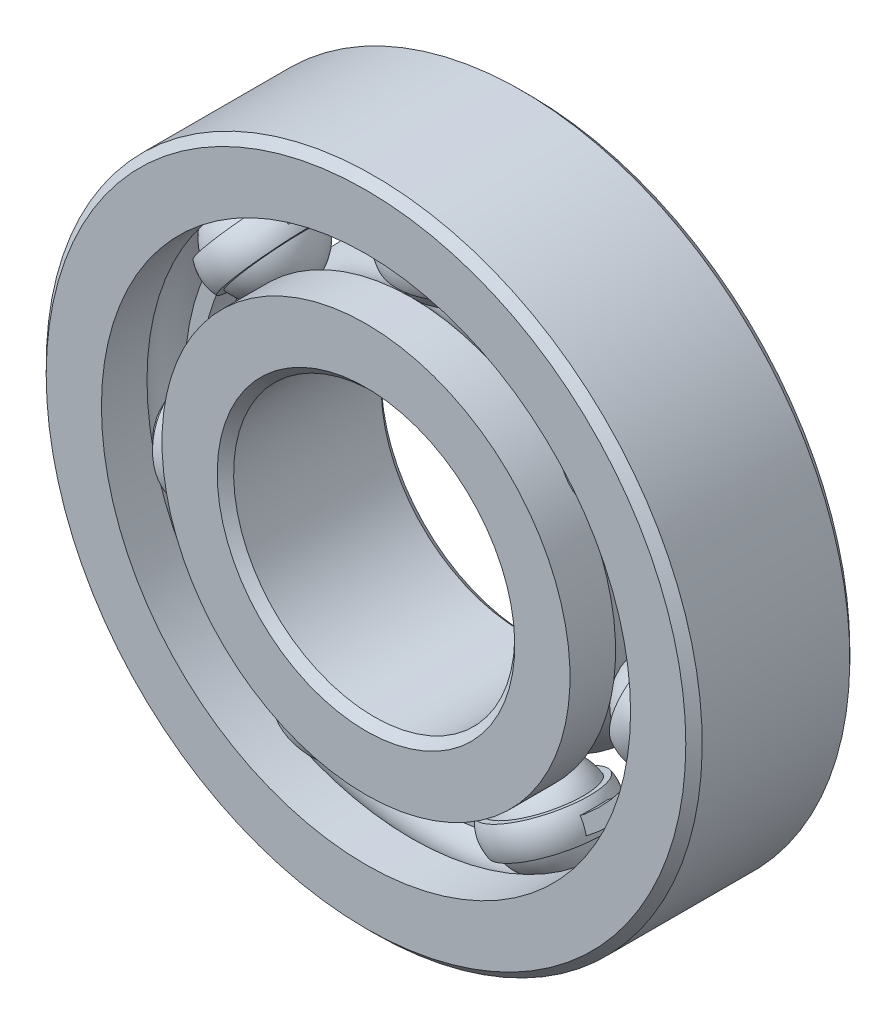
ISO-10303-21;
HEADER;
FILE_DESCRIPTION(('STEP AP214'),'2;1');
FILE_NAME('part.step','',(''),(''),'','','');
FILE_SCHEMA(('AUTOMOTIVE_DESIGN { 1 0 10303 214 1 1 1 1 }'));
ENDSEC;
DATA;
#1=APPLICATION_CONTEXT('core data for automotive mechanical design processes');
#2=APPLICATION_PROTOCOL_DEFINITION('international standard','automotive_design',2000,#1);
#3=PRODUCT_CONTEXT('',#1,'mechanical');
#4=PRODUCT('Part','Part','',(#3));
#5=PRODUCT_RELATED_PRODUCT_CATEGORY('part','',(#4));
#6=PRODUCT_DEFINITION_FORMATION('','',#4);
#7=PRODUCT_DEFINITION_CONTEXT('part definition',#1,'design');
#8=PRODUCT_DEFINITION('design','',#6,#7);
#9=PRODUCT_DEFINITION_SHAPE('','',#8);
#10=(LENGTH_UNIT() NAMED_UNIT(*) SI_UNIT(.MILLI.,.METRE.));
#11=(NAMED_UNIT(*) PLANE_ANGLE_UNIT() SI_UNIT($,.RADIAN.));
#12=(NAMED_UNIT(*) SI_UNIT($,.STERADIAN.) SOLID_ANGLE_UNIT());
#13=UNCERTAINTY_MEASURE_WITH_UNIT(LENGTH_MEASURE(1.E-05),#10,'distance_accuracy_value','');
#14=(GEOMETRIC_REPRESENTATION_CONTEXT(3) GLOBAL_UNCERTAINTY_ASSIGNED_CONTEXT((#13)) GLOBAL_UNIT_ASSIGNED_CONTEXT((#10,
#11,#12)) REPRESENTATION_CONTEXT('',''));
#15=CARTESIAN_POINT('',(0.,0.,0.));
#16=DIRECTION('',(0.,0.,1.));
#17=DIRECTION('',(1.,0.,0.));
#18=AXIS2_PLACEMENT_3D('',#15,#16,#17);
#19=CARTESIAN_POINT('',(0.,0.,0.463020833333333));
#20=DIRECTION('',(0.,0.,1.));
#21=DIRECTION('',(1.,0.,0.));
#22=AXIS2_PLACEMENT_3D('',#19,#20,#21);
#23=PLANE('',#22);
#24=CARTESIAN_POINT('',(0.,0.,0.463020833333333));
#25=DIRECTION('',(0.,0.,1.));
#26=DIRECTION('',(1.,0.,0.));
#27=AXIS2_PLACEMENT_3D('',#24,#25,#26);
#28=CIRCLE('',#27,8.45038461538461);
#29=CARTESIAN_POINT('',(8.45038461538461,0.,0.463020833333333));
#30=VERTEX_POINT('',#29);
#31=EDGE_CURVE('E11',#30,#30,#28,.T.);
#32=ORIENTED_EDGE('',*,*,#31,.T.);
#33=EDGE_LOOP('',(#32));
#34=FACE_BOUND('',#33,.T.);
#35=CARTESIAN_POINT('',(0.,0.,0.463020833333333));
#36=DIRECTION('',(0.,0.,1.));
#37=DIRECTION('',(1.,0.,0.));
#38=AXIS2_PLACEMENT_3D('',#35,#36,#37);
#39=CIRCLE('',#38,7.9375);
#40=CARTESIAN_POINT('',(7.9375,0.,0.463020833333333));
#41=VERTEX_POINT('',#40);
#42=EDGE_CURVE('E55',#41,#41,#39,.T.);
#43=ORIENTED_EDGE('',*,*,#42,.F.);
#44=EDGE_LOOP('',(#43));
#45=FACE_BOUND('',#44,.T.);
#46=ADVANCED_FACE('F44',(#34,#45),#23,.T.);
#47=CARTESIAN_POINT('',(0.,0.,-0.463020833333333));
#48=DIRECTION('',(0.,0.,1.));
#49=DIRECTION('',(1.,0.,0.));
#50=AXIS2_PLACEMENT_3D('',#47,#48,#49);
#51=PLANE('',#50);
#52=CARTESIAN_POINT('',(0.,0.,-0.463020833333333));
#53=DIRECTION('',(0.,0.,1.));
#54=DIRECTION('',(1.,0.,0.));
#55=AXIS2_PLACEMENT_3D('',#52,#53,#54);
#56=CIRCLE('',#55,8.45038461538461);
#57=CARTESIAN_POINT('',(8.45038461538461,0.,-0.463020833333333));
#58=VERTEX_POINT('',#57);
#59=EDGE_CURVE('E48',#58,#58,#56,.T.);
#60=ORIENTED_EDGE('',*,*,#59,.F.);
#61=EDGE_LOOP('',(#60));
#62=FACE_BOUND('',#61,.T.);
#63=CARTESIAN_POINT('',(0.,0.,-0.463020833333333));
#64=DIRECTION('',(0.,0.,1.));
#65=DIRECTION('',(1.,0.,0.));
#66=AXIS2_PLACEMENT_3D('',#63,#64,#65);
#67=CIRCLE('',#66,7.9375);
#68=CARTESIAN_POINT('',(7.9375,0.,-0.463020833333333));
#69=VERTEX_POINT('',#68);
#70=EDGE_CURVE('E57',#69,#69,#67,.T.);
#71=ORIENTED_EDGE('',*,*,#70,.T.);
#72=EDGE_LOOP('',(#71));
#73=FACE_BOUND('',#72,.T.);
#74=ADVANCED_FACE('F67',(#62,#73),#51,.F.);
#75=CARTESIAN_POINT('',(0.,0.,0.463020833333333));
#76=DIRECTION('',(0.,0.,-1.));
#77=DIRECTION('',(-1.,0.,0.));
#78=AXIS2_PLACEMENT_3D('',#75,#76,#77);
#79=CYLINDRICAL_SURFACE('',#78,8.45038461538461);
#80=ORIENTED_EDGE('',*,*,#31,.F.);
#81=EDGE_LOOP('',(#80));
#82=FACE_BOUND('',#81,.T.);
#83=ORIENTED_EDGE('',*,*,#59,.T.);
#84=EDGE_LOOP('',(#83));
#85=FACE_BOUND('',#84,.T.);
#86=ADVANCED_FACE('F46',(#82,#85),#79,.T.);
#87=CARTESIAN_POINT('',(0.,0.,0.463020833333333));
#88=DIRECTION('',(0.,0.,-1.));
#89=DIRECTION('',(-1.,0.,0.));
#90=AXIS2_PLACEMENT_3D('',#87,#88,#89);
#91=CYLINDRICAL_SURFACE('',#90,7.9375);
#92=ORIENTED_EDGE('',*,*,#42,.T.);
#93=EDGE_LOOP('',(#92));
#94=FACE_BOUND('',#93,.T.);
#95=ORIENTED_EDGE('',*,*,#70,.F.);
#96=EDGE_LOOP('',(#95));
#97=FACE_BOUND('',#96,.T.);
#98=ADVANCED_FACE('F63',(#94,#97),#91,.F.);
#99=CLOSED_SHELL('',(#46,#74,#86,#98));
#100=MANIFOLD_SOLID_BREP('B2',#99);
#101=CARTESIAN_POINT('',(-6.20578739208993,4.94895030225377,0.));
#102=DIRECTION('',(0.,0.,1.));
#103=DIRECTION('',(-0.781831482468022,0.623489801858743,0.));
#104=AXIS2_PLACEMENT_3D('',#101,#102,#103);
#105=SPHERICAL_SURFACE('',#104,1.60522318723668);
#106=CARTESIAN_POINT('',(-6.20578739208993,4.94895030225377,1.60522318723668));
#107=VERTEX_POINT('',#106);
#108=VERTEX_LOOP('',#107);
#109=FACE_BOUND('',#108,.T.);
#110=ADVANCED_FACE('F112',(#109),#105,.T.);
#111=CLOSED_SHELL('',(#110));
#112=MANIFOLD_SOLID_BREP('B6',#111);
#113=CARTESIAN_POINT('',(-7.73849030294324,-1.76625991327817,0.));
#114=DIRECTION('',(0.,0.,1.));
#115=DIRECTION('',(-0.974927912181826,-0.222520933956305,0.));
#116=AXIS2_PLACEMENT_3D('',#113,#114,#115);
#117=SPHERICAL_SURFACE('',#116,1.60522318723668);
#118=CARTESIAN_POINT('',(-7.73849030294324,-1.76625991327817,1.60522318723668));
#119=VERTEX_POINT('',#118);
#120=VERTEX_LOOP('',#119);
#121=FACE_BOUND('',#120,.T.);
#122=ADVANCED_FACE('F131',(#121),#117,.T.);
#123=CLOSED_SHELL('',(#122));
#124=MANIFOLD_SOLID_BREP('B40',#123);
#125=CARTESIAN_POINT('',(-3.44395217924567,-7.15144038897543,0.));
#126=DIRECTION('',(0.,0.,1.));
#127=DIRECTION('',(-0.433883739117565,-0.900968867902416,0.));
#128=AXIS2_PLACEMENT_3D('',#125,#126,#127);
#129=SPHERICAL_SURFACE('',#128,1.60522318723668);
#130=CARTESIAN_POINT('',(-3.44395217924567,-7.15144038897543,1.60522318723667));
#131=VERTEX_POINT('',#130);
#132=VERTEX_LOOP('',#131);
#133=FACE_BOUND('',#132,.T.);
#134=ADVANCED_FACE('F150',(#133),#129,.T.);
#135=CLOSED_SHELL('',(#134));
#136=MANIFOLD_SOLID_BREP('B108',#135);
#137=CARTESIAN_POINT('',(3.44395217924557,-7.15144038897547,0.));
#138=DIRECTION('',(0.,0.,1.));
#139=DIRECTION('',(0.433883739117553,-0.900968867902422,0.));
#140=AXIS2_PLACEMENT_3D('',#137,#138,#139);
#141=SPHERICAL_SURFACE('',#140,1.60522318723668);
#142=CARTESIAN_POINT('',(3.44395217924557,-7.15144038897547,1.60522318723667));
#143=VERTEX_POINT('',#142);
#144=VERTEX_LOOP('',#143);
#145=FACE_BOUND('',#144,.T.);
#146=ADVANCED_FACE('F169',(#145),#141,.T.);
#147=CLOSED_SHELL('',(#146));
#148=MANIFOLD_SOLID_BREP('B127',#147);
#149=CARTESIAN_POINT('',(7.73849030294322,-1.76625991327828,0.));
#150=DIRECTION('',(0.,0.,1.));
#151=DIRECTION('',(0.974927912181823,-0.222520933956318,0.));
#152=AXIS2_PLACEMENT_3D('',#149,#150,#151);
#153=SPHERICAL_SURFACE('',#152,1.60522318723668);
#154=CARTESIAN_POINT('',(7.73849030294322,-1.76625991327828,1.60522318723668));
#155=VERTEX_POINT('',#154);
#156=VERTEX_LOOP('',#155);
#157=FACE_BOUND('',#156,.T.);
#158=ADVANCED_FACE('F188',(#157),#153,.T.);
#159=CLOSED_SHELL('',(#158));
#160=MANIFOLD_SOLID_BREP('B146',#159);
#161=CARTESIAN_POINT('',(6.20578739209,4.94895030225369,0.));
#162=DIRECTION('',(0.,0.,1.));
#163=DIRECTION('',(0.781831482468031,0.623489801858732,0.));
#164=AXIS2_PLACEMENT_3D('',#161,#162,#163);
#165=SPHERICAL_SURFACE('',#164,1.60522318723668);
#166=CARTESIAN_POINT('',(6.20578739209,4.94895030225369,1.60522318723668));
#167=VERTEX_POINT('',#166);
#168=VERTEX_LOOP('',#167);
#169=FACE_BOUND('',#168,.T.);
#170=ADVANCED_FACE('F209',(#169),#165,.T.);
#171=CLOSED_SHELL('',(#170));
#172=MANIFOLD_SOLID_BREP('B165',#171);
#173=CARTESIAN_POINT('',(-6.20578739208992,4.94895030225377,0.));
#174=DIRECTION('',(-0.781831482468022,0.623489801858743,0.));
#175=DIRECTION('',(0.,0.,1.));
#176=AXIS2_PLACEMENT_3D('',#173,#174,#175);
#177=DEGENERATE_TOROIDAL_SURFACE('',#176,0.527397289201908,1.30794555976219,.T.);
#178=CARTESIAN_POINT('',(-5.80479805290873,4.62917197503122,0.));
#179=DIRECTION('',(-0.781831482468022,0.623489801858743,0.));
#180=DIRECTION('',(0.,0.,1.));
#181=AXIS2_PLACEMENT_3D('',#178,#179,#180);
#182=CIRCLE('',#181,1.73058927662678);
#183=CARTESIAN_POINT('',(-5.80479805290873,4.62917197503122,1.73058927662678));
#184=VERTEX_POINT('',#183);
#185=EDGE_CURVE('E244',#184,#184,#182,.T.);
#186=ORIENTED_EDGE('',*,*,#185,.T.);
#187=EDGE_LOOP('',(#186));
#188=FACE_BOUND('',#187,.T.);
#189=CARTESIAN_POINT('',(-6.60677673127112,5.26872862947632,0.));
#190=DIRECTION('',(-0.781831482468022,0.623489801858743,0.));
#191=DIRECTION('',(0.,0.,1.));
#192=AXIS2_PLACEMENT_3D('',#189,#190,#191);
#193=CIRCLE('',#192,1.73058927662678);
#194=CARTESIAN_POINT('',(-6.60677673127112,5.26872862947632,1.73058927662678));
#195=VERTEX_POINT('',#194);
#196=EDGE_CURVE('E208',#195,#195,#193,.T.);
#197=ORIENTED_EDGE('',*,*,#196,.F.);
#198=EDGE_LOOP('',(#197));
#199=FACE_BOUND('',#198,.T.);
#200=ADVANCED_FACE('F230',(#188,#199),#177,.T.);
#201=CARTESIAN_POINT('',(-6.60677673127112,5.26872862947632,1.52108213195213));
#202=DIRECTION('',(-0.781831482468022,0.623489801858743,0.));
#203=DIRECTION('',(0.,0.,1.));
#204=AXIS2_PLACEMENT_3D('',#201,#202,#203);
#205=PLANE('',#204);
#206=ORIENTED_EDGE('',*,*,#196,.T.);
#207=EDGE_LOOP('',(#206));
#208=FACE_BOUND('',#207,.T.);
#209=CARTESIAN_POINT('',(-6.60677673127112,5.26872862947632,0.));
#210=DIRECTION('',(-0.781831482468022,0.623489801858743,0.));
#211=DIRECTION('',(0.,0.,1.));
#212=AXIS2_PLACEMENT_3D('',#209,#210,#211);
#213=CIRCLE('',#212,1.52108213195213);
#214=CARTESIAN_POINT('',(-6.60677673127112,5.26872862947632,1.52108213195213));
#215=VERTEX_POINT('',#214);
#216=EDGE_CURVE('E236',#215,#215,#213,.T.);
#217=ORIENTED_EDGE('',*,*,#216,.F.);
#218=EDGE_LOOP('',(#217));
#219=FACE_BOUND('',#218,.T.);
#220=ADVANCED_FACE('F260',(#208,#219),#205,.T.);
#221=CARTESIAN_POINT('',(-6.20578739208992,4.94895030225377,0.));
#222=DIRECTION('',(-0.781831482468022,0.623489801858743,0.));
#223=DIRECTION('',(0.,0.,1.));
#224=AXIS2_PLACEMENT_3D('',#221,#222,#223);
#225=SPHERICAL_SURFACE('',#224,1.60522318723668);
#226=ORIENTED_EDGE('',*,*,#216,.T.);
#227=EDGE_LOOP('',(#226));
#228=FACE_BOUND('',#227,.T.);
#229=CARTESIAN_POINT('',(-5.80479805290873,4.62917197503122,0.));
#230=DIRECTION('',(-0.781831482468022,0.623489801858743,0.));
#231=DIRECTION('',(0.,0.,1.));
#232=AXIS2_PLACEMENT_3D('',#229,#230,#231);
#233=CIRCLE('',#232,1.52108213195213);
#234=CARTESIAN_POINT('',(-5.80479805290873,4.62917197503122,1.52108213195213));
#235=VERTEX_POINT('',#234);
#236=EDGE_CURVE('E240',#235,#235,#233,.T.);
#237=ORIENTED_EDGE('',*,*,#236,.F.);
#238=EDGE_LOOP('',(#237));
#239=FACE_BOUND('',#238,.T.);
#240=ADVANCED_FACE('F254',(#228,#239),#225,.F.);
#241=CARTESIAN_POINT('',(-5.80479805290873,4.62917197503122,1.52108213195213));
#242=DIRECTION('',(0.781831482468022,-0.623489801858743,0.));
#243=DIRECTION('',(0.,0.,-1.));
#244=AXIS2_PLACEMENT_3D('',#241,#242,#243);
#245=PLANE('',#244);
#246=ORIENTED_EDGE('',*,*,#236,.T.);
#247=EDGE_LOOP('',(#246));
#248=FACE_BOUND('',#247,.T.);
#249=ORIENTED_EDGE('',*,*,#185,.F.);
#250=EDGE_LOOP('',(#249));
#251=FACE_BOUND('',#250,.T.);
#252=ADVANCED_FACE('F252',(#248,#251),#245,.T.);
#253=CLOSED_SHELL('',(#200,#220,#240,#252));
#254=MANIFOLD_SOLID_BREP('B184',#253);
#255=CARTESIAN_POINT('',(-7.73849030294324,-1.76625991327817,0.));
#256=DIRECTION('',(-0.974927912181826,-0.222520933956305,0.));
#257=DIRECTION('',(0.,0.,1.));
#258=AXIS2_PLACEMENT_3D('',#255,#256,#257);
#259=DEGENERATE_TOROIDAL_SURFACE('',#258,0.527397289201908,1.30794555976219,.T.);
#260=CARTESIAN_POINT('',(-7.23846477567614,-1.65213234965097,0.));
#261=DIRECTION('',(-0.974927912181826,-0.222520933956305,0.));
#262=DIRECTION('',(0.,0.,1.));
#263=AXIS2_PLACEMENT_3D('',#260,#261,#262);
#264=CIRCLE('',#263,1.73058927662678);
#265=CARTESIAN_POINT('',(-7.23846477567614,-1.65213234965097,1.73058927662678));
#266=VERTEX_POINT('',#265);
#267=EDGE_CURVE('E314',#266,#266,#264,.T.);
#268=ORIENTED_EDGE('',*,*,#267,.T.);
#269=EDGE_LOOP('',(#268));
#270=FACE_BOUND('',#269,.T.);
#271=CARTESIAN_POINT('',(-8.23851583021034,-1.88038747690538,0.));
#272=DIRECTION('',(-0.974927912181826,-0.222520933956305,0.));
#273=DIRECTION('',(0.,0.,1.));
#274=AXIS2_PLACEMENT_3D('',#271,#272,#273);
#275=CIRCLE('',#274,1.73058927662678);
#276=CARTESIAN_POINT('',(-8.23851583021034,-1.88038747690538,1.73058927662678));
#277=VERTEX_POINT('',#276);
#278=EDGE_CURVE('E229',#277,#277,#275,.T.);
#279=ORIENTED_EDGE('',*,*,#278,.F.);
#280=EDGE_LOOP('',(#279));
#281=FACE_BOUND('',#280,.T.);
#282=ADVANCED_FACE('F300',(#270,#281),#259,.T.);
#283=CARTESIAN_POINT('',(-8.23851583021034,-1.88038747690538,1.52108213195213));
#284=DIRECTION('',(-0.974927912181826,-0.222520933956305,0.));
#285=DIRECTION('',(0.,0.,1.));
#286=AXIS2_PLACEMENT_3D('',#283,#284,#285);
#287=PLANE('',#286);
#288=ORIENTED_EDGE('',*,*,#278,.T.);
#289=EDGE_LOOP('',(#288));
#290=FACE_BOUND('',#289,.T.);
#291=CARTESIAN_POINT('',(-8.23851583021034,-1.88038747690538,0.));
#292=DIRECTION('',(-0.974927912181826,-0.222520933956305,0.));
#293=DIRECTION('',(0.,0.,1.));
#294=AXIS2_PLACEMENT_3D('',#291,#292,#293);
#295=CIRCLE('',#294,1.52108213195213);
#296=CARTESIAN_POINT('',(-8.23851583021034,-1.88038747690538,1.52108213195213));
#297=VERTEX_POINT('',#296);
#298=EDGE_CURVE('E306',#297,#297,#295,.T.);
#299=ORIENTED_EDGE('',*,*,#298,.F.);
#300=EDGE_LOOP('',(#299));
#301=FACE_BOUND('',#300,.T.);
#302=ADVANCED_FACE('F330',(#290,#301),#287,.T.);
#303=CARTESIAN_POINT('',(-7.73849030294324,-1.76625991327817,0.));
#304=DIRECTION('',(-0.974927912181826,-0.222520933956305,0.));
#305=DIRECTION('',(0.,0.,1.));
#306=AXIS2_PLACEMENT_3D('',#303,#304,#305);
#307=SPHERICAL_SURFACE('',#306,1.60522318723668);
#308=ORIENTED_EDGE('',*,*,#298,.T.);
#309=EDGE_LOOP('',(#308));
#310=FACE_BOUND('',#309,.T.);
#311=CARTESIAN_POINT('',(-7.23846477567614,-1.65213234965097,0.));
#312=DIRECTION('',(-0.974927912181826,-0.222520933956305,0.));
#313=DIRECTION('',(0.,0.,1.));
#314=AXIS2_PLACEMENT_3D('',#311,#312,#313);
#315=CIRCLE('',#314,1.52108213195213);
#316=CARTESIAN_POINT('',(-7.23846477567614,-1.65213234965097,1.52108213195213));
#317=VERTEX_POINT('',#316);
#318=EDGE_CURVE('E310',#317,#317,#315,.T.);
#319=ORIENTED_EDGE('',*,*,#318,.F.);
#320=EDGE_LOOP('',(#319));
#321=FACE_BOUND('',#320,.T.);
#322=ADVANCED_FACE('F324',(#310,#321),#307,.F.);
#323=CARTESIAN_POINT('',(-7.23846477567614,-1.65213234965097,1.52108213195213));
#324=DIRECTION('',(0.974927912181826,0.222520933956305,0.));
#325=DIRECTION('',(0.,0.,-1.));
#326=AXIS2_PLACEMENT_3D('',#323,#324,#325);
#327=PLANE('',#326);
#328=ORIENTED_EDGE('',*,*,#318,.T.);
#329=EDGE_LOOP('',(#328));
#330=FACE_BOUND('',#329,.T.);
#331=ORIENTED_EDGE('',*,*,#267,.F.);
#332=EDGE_LOOP('',(#331));
#333=FACE_BOUND('',#332,.T.);
#334=ADVANCED_FACE('F322',(#330,#333),#327,.T.);
#335=CLOSED_SHELL('',(#282,#302,#322,#334));
#336=MANIFOLD_SOLID_BREP('B203',#335);
#337=CARTESIAN_POINT('',(-3.44395217924567,-7.15144038897542,0.));
#338=DIRECTION('',(-0.433883739117565,-0.900968867902416,0.));
#339=DIRECTION('',(0.,0.,1.));
#340=AXIS2_PLACEMENT_3D('',#337,#338,#339);
#341=DEGENERATE_TOROIDAL_SURFACE('',#340,0.527397289201908,1.30794555976219,.T.);
#342=CARTESIAN_POINT('',(-3.22141988458672,-6.68934731768778,0.));
#343=DIRECTION('',(-0.433883739117565,-0.900968867902416,0.));
#344=DIRECTION('',(0.,0.,1.));
#345=AXIS2_PLACEMENT_3D('',#342,#343,#344);
#346=CIRCLE('',#345,1.73058927662678);
#347=CARTESIAN_POINT('',(-3.22141988458672,-6.68934731768778,1.73058927662678));
#348=VERTEX_POINT('',#347);
#349=EDGE_CURVE('E384',#348,#348,#346,.T.);
#350=ORIENTED_EDGE('',*,*,#349,.T.);
#351=EDGE_LOOP('',(#350));
#352=FACE_BOUND('',#351,.T.);
#353=CARTESIAN_POINT('',(-3.66648447390462,-7.61353346026307,0.));
#354=DIRECTION('',(-0.433883739117565,-0.900968867902416,0.));
#355=DIRECTION('',(0.,0.,1.));
#356=AXIS2_PLACEMENT_3D('',#353,#354,#355);
#357=CIRCLE('',#356,1.73058927662678);
#358=CARTESIAN_POINT('',(-3.66648447390462,-7.61353346026307,1.73058927662678));
#359=VERTEX_POINT('',#358);
#360=EDGE_CURVE('E299',#359,#359,#357,.T.);
#361=ORIENTED_EDGE('',*,*,#360,.F.);
#362=EDGE_LOOP('',(#361));
#363=FACE_BOUND('',#362,.T.);
#364=ADVANCED_FACE('F370',(#352,#363),#341,.T.);
#365=CARTESIAN_POINT('',(-3.66648447390462,-7.61353346026307,1.52108213195213));
#366=DIRECTION('',(-0.433883739117565,-0.900968867902416,0.));
#367=DIRECTION('',(0.,0.,1.));
#368=AXIS2_PLACEMENT_3D('',#365,#366,#367);
#369=PLANE('',#368);
#370=ORIENTED_EDGE('',*,*,#360,.T.);
#371=EDGE_LOOP('',(#370));
#372=FACE_BOUND('',#371,.T.);
#373=CARTESIAN_POINT('',(-3.66648447390462,-7.61353346026307,0.));
#374=DIRECTION('',(-0.433883739117565,-0.900968867902416,0.));
#375=DIRECTION('',(0.,0.,1.));
#376=AXIS2_PLACEMENT_3D('',#373,#374,#375);
#377=CIRCLE('',#376,1.52108213195213);
#378=CARTESIAN_POINT('',(-3.66648447390462,-7.61353346026307,1.52108213195213));
#379=VERTEX_POINT('',#378);
#380=EDGE_CURVE('E376',#379,#379,#377,.T.);
#381=ORIENTED_EDGE('',*,*,#380,.F.);
#382=EDGE_LOOP('',(#381));
#383=FACE_BOUND('',#382,.T.);
#384=ADVANCED_FACE('F400',(#372,#383),#369,.T.);
#385=CARTESIAN_POINT('',(-3.44395217924567,-7.15144038897542,0.));
#386=DIRECTION('',(-0.433883739117565,-0.900968867902416,0.));
#387=DIRECTION('',(0.,0.,1.));
#388=AXIS2_PLACEMENT_3D('',#385,#386,#387);
#389=SPHERICAL_SURFACE('',#388,1.60522318723668);
#390=ORIENTED_EDGE('',*,*,#380,.T.);
#391=EDGE_LOOP('',(#390));
#392=FACE_BOUND('',#391,.T.);
#393=CARTESIAN_POINT('',(-3.22141988458672,-6.68934731768778,0.));
#394=DIRECTION('',(-0.433883739117565,-0.900968867902416,0.));
#395=DIRECTION('',(0.,0.,1.));
#396=AXIS2_PLACEMENT_3D('',#393,#394,#395);
#397=CIRCLE('',#396,1.52108213195213);
#398=CARTESIAN_POINT('',(-3.22141988458672,-6.68934731768778,1.52108213195213));
#399=VERTEX_POINT('',#398);
#400=EDGE_CURVE('E380',#399,#399,#397,.T.);
#401=ORIENTED_EDGE('',*,*,#400,.F.);
#402=EDGE_LOOP('',(#401));
#403=FACE_BOUND('',#402,.T.);
#404=ADVANCED_FACE('F394',(#392,#403),#389,.F.);
#405=CARTESIAN_POINT('',(-3.22141988458672,-6.68934731768778,1.52108213195213));
#406=DIRECTION('',(0.433883739117565,0.900968867902416,0.));
#407=DIRECTION('',(0.,0.,-1.));
#408=AXIS2_PLACEMENT_3D('',#405,#406,#407);
#409=PLANE('',#408);
#410=ORIENTED_EDGE('',*,*,#400,.T.);
#411=EDGE_LOOP('',(#410));
#412=FACE_BOUND('',#411,.T.);
#413=ORIENTED_EDGE('',*,*,#349,.F.);
#414=EDGE_LOOP('',(#413));
#415=FACE_BOUND('',#414,.T.);
#416=ADVANCED_FACE('F392',(#412,#415),#409,.T.);
#417=CLOSED_SHELL('',(#364,#384,#404,#416));
#418=MANIFOLD_SOLID_BREP('B224',#417);
#419=CARTESIAN_POINT('',(3.44395217924557,-7.15144038897547,0.));
#420=DIRECTION('',(0.433883739117553,-0.900968867902422,0.));
#421=DIRECTION('',(0.,0.,1.));
#422=AXIS2_PLACEMENT_3D('',#419,#420,#421);
#423=DEGENERATE_TOROIDAL_SURFACE('',#422,0.527397289201908,1.30794555976219,.T.);
#424=CARTESIAN_POINT('',(3.22141988458663,-6.68934731768783,0.));
#425=DIRECTION('',(0.433883739117553,-0.900968867902422,0.));
#426=DIRECTION('',(0.,0.,1.));
#427=AXIS2_PLACEMENT_3D('',#424,#425,#426);
#428=CIRCLE('',#427,1.73058927662678);
#429=CARTESIAN_POINT('',(3.22141988458663,-6.68934731768783,1.73058927662678));
#430=VERTEX_POINT('',#429);
#431=EDGE_CURVE('E454',#430,#430,#428,.T.);
#432=ORIENTED_EDGE('',*,*,#431,.T.);
#433=EDGE_LOOP('',(#432));
#434=FACE_BOUND('',#433,.T.);
#435=CARTESIAN_POINT('',(3.66648447390452,-7.61353346026312,0.));
#436=DIRECTION('',(0.433883739117553,-0.900968867902422,0.));
#437=DIRECTION('',(0.,0.,1.));
#438=AXIS2_PLACEMENT_3D('',#435,#436,#437);
#439=CIRCLE('',#438,1.73058927662678);
#440=CARTESIAN_POINT('',(3.66648447390452,-7.61353346026312,1.73058927662678));
#441=VERTEX_POINT('',#440);
#442=EDGE_CURVE('E369',#441,#441,#439,.T.);
#443=ORIENTED_EDGE('',*,*,#442,.F.);
#444=EDGE_LOOP('',(#443));
#445=FACE_BOUND('',#444,.T.);
#446=ADVANCED_FACE('F440',(#434,#445),#423,.T.);
#447=CARTESIAN_POINT('',(3.66648447390452,-7.61353346026312,1.52108213195213));
#448=DIRECTION('',(0.433883739117553,-0.900968867902422,0.));
#449=DIRECTION('',(0.,0.,1.));
#450=AXIS2_PLACEMENT_3D('',#447,#448,#449);
#451=PLANE('',#450);
#452=ORIENTED_EDGE('',*,*,#442,.T.);
#453=EDGE_LOOP('',(#452));
#454=FACE_BOUND('',#453,.T.);
#455=CARTESIAN_POINT('',(3.66648447390452,-7.61353346026312,0.));
#456=DIRECTION('',(0.433883739117553,-0.900968867902422,0.));
#457=DIRECTION('',(0.,0.,1.));
#458=AXIS2_PLACEMENT_3D('',#455,#456,#457);
#459=CIRCLE('',#458,1.52108213195213);
#460=CARTESIAN_POINT('',(3.66648447390452,-7.61353346026312,1.52108213195213));
#461=VERTEX_POINT('',#460);
#462=EDGE_CURVE('E446',#461,#461,#459,.T.);
#463=ORIENTED_EDGE('',*,*,#462,.F.);
#464=EDGE_LOOP('',(#463));
#465=FACE_BOUND('',#464,.T.);
#466=ADVANCED_FACE('F470',(#454,#465),#451,.T.);
#467=CARTESIAN_POINT('',(3.44395217924557,-7.15144038897547,0.));
#468=DIRECTION('',(0.433883739117553,-0.900968867902422,0.));
#469=DIRECTION('',(0.,0.,1.));
#470=AXIS2_PLACEMENT_3D('',#467,#468,#469);
#471=SPHERICAL_SURFACE('',#470,1.60522318723668);
#472=ORIENTED_EDGE('',*,*,#462,.T.);
#473=EDGE_LOOP('',(#472));
#474=FACE_BOUND('',#473,.T.);
#475=CARTESIAN_POINT('',(3.22141988458663,-6.68934731768783,0.));
#476=DIRECTION('',(0.433883739117553,-0.900968867902422,0.));
#477=DIRECTION('',(0.,0.,1.));
#478=AXIS2_PLACEMENT_3D('',#475,#476,#477);
#479=CIRCLE('',#478,1.52108213195213);
#480=CARTESIAN_POINT('',(3.22141988458663,-6.68934731768783,1.52108213195213));
#481=VERTEX_POINT('',#480);
#482=EDGE_CURVE('E450',#481,#481,#479,.T.);
#483=ORIENTED_EDGE('',*,*,#482,.F.);
#484=EDGE_LOOP('',(#483));
#485=FACE_BOUND('',#484,.T.);
#486=ADVANCED_FACE('F464',(#474,#485),#471,.F.);
#487=CARTESIAN_POINT('',(3.22141988458663,-6.68934731768783,1.52108213195213));
#488=DIRECTION('',(-0.433883739117553,0.900968867902422,0.));
#489=DIRECTION('',(0.,0.,-1.));
#490=AXIS2_PLACEMENT_3D('',#487,#488,#489);
#491=PLANE('',#490);
#492=ORIENTED_EDGE('',*,*,#482,.T.);
#493=EDGE_LOOP('',(#492));
#494=FACE_BOUND('',#493,.T.);
#495=ORIENTED_EDGE('',*,*,#431,.F.);
#496=EDGE_LOOP('',(#495));
#497=FACE_BOUND('',#496,.T.);
#498=ADVANCED_FACE('F462',(#494,#497),#491,.T.);
#499=CLOSED_SHELL('',(#446,#466,#486,#498));
#500=MANIFOLD_SOLID_BREP('B294',#499);
#501=CARTESIAN_POINT('',(7.73849030294321,-1.76625991327828,0.));
#502=DIRECTION('',(0.974927912181823,-0.222520933956318,0.));
#503=DIRECTION('',(0.,0.,1.));
#504=AXIS2_PLACEMENT_3D('',#501,#502,#503);
#505=DEGENERATE_TOROIDAL_SURFACE('',#504,0.527397289201908,1.30794555976219,.T.);
#506=CARTESIAN_POINT('',(7.23846477567612,-1.65213234965106,0.));
#507=DIRECTION('',(0.974927912181823,-0.222520933956318,0.));
#508=DIRECTION('',(0.,0.,1.));
#509=AXIS2_PLACEMENT_3D('',#506,#507,#508);
#510=CIRCLE('',#509,1.73058927662678);
#511=CARTESIAN_POINT('',(7.23846477567612,-1.65213234965106,1.73058927662678));
#512=VERTEX_POINT('',#511);
#513=EDGE_CURVE('E524',#512,#512,#510,.T.);
#514=ORIENTED_EDGE('',*,*,#513,.T.);
#515=EDGE_LOOP('',(#514));
#516=FACE_BOUND('',#515,.T.);
#517=CARTESIAN_POINT('',(8.23851583021032,-1.88038747690549,0.));
#518=DIRECTION('',(0.974927912181823,-0.222520933956318,0.));
#519=DIRECTION('',(0.,0.,1.));
#520=AXIS2_PLACEMENT_3D('',#517,#518,#519);
#521=CIRCLE('',#520,1.73058927662678);
#522=CARTESIAN_POINT('',(8.23851583021032,-1.88038747690549,1.73058927662678));
#523=VERTEX_POINT('',#522);
#524=EDGE_CURVE('E439',#523,#523,#521,.T.);
#525=ORIENTED_EDGE('',*,*,#524,.F.);
#526=EDGE_LOOP('',(#525));
#527=FACE_BOUND('',#526,.T.);
#528=ADVANCED_FACE('F510',(#516,#527),#505,.T.);
#529=CARTESIAN_POINT('',(8.23851583021032,-1.88038747690549,1.52108213195213));
#530=DIRECTION('',(0.974927912181823,-0.222520933956318,0.));
#531=DIRECTION('',(0.,0.,1.));
#532=AXIS2_PLACEMENT_3D('',#529,#530,#531);
#533=PLANE('',#532);
#534=ORIENTED_EDGE('',*,*,#524,.T.);
#535=EDGE_LOOP('',(#534));
#536=FACE_BOUND('',#535,.T.);
#537=CARTESIAN_POINT('',(8.23851583021032,-1.88038747690549,0.));
#538=DIRECTION('',(0.974927912181823,-0.222520933956318,0.));
#539=DIRECTION('',(0.,0.,1.));
#540=AXIS2_PLACEMENT_3D('',#537,#538,#539);
#541=CIRCLE('',#540,1.52108213195213);
#542=CARTESIAN_POINT('',(8.23851583021032,-1.88038747690549,1.52108213195213));
#543=VERTEX_POINT('',#542);
#544=EDGE_CURVE('E516',#543,#543,#541,.T.);
#545=ORIENTED_EDGE('',*,*,#544,.F.);
#546=EDGE_LOOP('',(#545));
#547=FACE_BOUND('',#546,.T.);
#548=ADVANCED_FACE('F540',(#536,#547),#533,.T.);
#549=CARTESIAN_POINT('',(7.73849030294322,-1.76625991327828,0.));
#550=DIRECTION('',(0.974927912181823,-0.222520933956318,0.));
#551=DIRECTION('',(0.,0.,1.));
#552=AXIS2_PLACEMENT_3D('',#549,#550,#551);
#553=SPHERICAL_SURFACE('',#552,1.60522318723668);
#554=ORIENTED_EDGE('',*,*,#544,.T.);
#555=EDGE_LOOP('',(#554));
#556=FACE_BOUND('',#555,.T.);
#557=CARTESIAN_POINT('',(7.23846477567612,-1.65213234965106,0.));
#558=DIRECTION('',(0.974927912181823,-0.222520933956318,0.));
#559=DIRECTION('',(0.,0.,1.));
#560=AXIS2_PLACEMENT_3D('',#557,#558,#559);
#561=CIRCLE('',#560,1.52108213195213);
#562=CARTESIAN_POINT('',(7.23846477567612,-1.65213234965106,1.52108213195213));
#563=VERTEX_POINT('',#562);
#564=EDGE_CURVE('E520',#563,#563,#561,.T.);
#565=ORIENTED_EDGE('',*,*,#564,.F.);
#566=EDGE_LOOP('',(#565));
#567=FACE_BOUND('',#566,.T.);
#568=ADVANCED_FACE('F534',(#556,#567),#553,.F.);
#569=CARTESIAN_POINT('',(7.23846477567612,-1.65213234965106,1.52108213195213));
#570=DIRECTION('',(-0.974927912181823,0.222520933956318,0.));
#571=DIRECTION('',(0.,0.,-1.));
#572=AXIS2_PLACEMENT_3D('',#569,#570,#571);
#573=PLANE('',#572);
#574=ORIENTED_EDGE('',*,*,#564,.T.);
#575=EDGE_LOOP('',(#574));
#576=FACE_BOUND('',#575,.T.);
#577=ORIENTED_EDGE('',*,*,#513,.F.);
#578=EDGE_LOOP('',(#577));
#579=FACE_BOUND('',#578,.T.);
#580=ADVANCED_FACE('F532',(#576,#579),#573,.T.);
#581=CLOSED_SHELL('',(#528,#548,#568,#580));
#582=MANIFOLD_SOLID_BREP('B364',#581);
#583=CARTESIAN_POINT('',(6.20578739208999,4.94895030225368,0.));
#584=DIRECTION('',(0.781831482468031,0.623489801858732,0.));
#585=DIRECTION('',(0.,0.,1.));
#586=AXIS2_PLACEMENT_3D('',#583,#584,#585);
#587=DEGENERATE_TOROIDAL_SURFACE('',#586,0.527397289201908,1.30794555976219,.T.);
#588=CARTESIAN_POINT('',(5.80479805290879,4.62917197503114,0.));
#589=DIRECTION('',(0.781831482468031,0.623489801858732,0.));
#590=DIRECTION('',(0.,0.,1.));
#591=AXIS2_PLACEMENT_3D('',#588,#589,#590);
#592=CIRCLE('',#591,1.73058927662678);
#593=CARTESIAN_POINT('',(5.80479805290879,4.62917197503114,1.73058927662678));
#594=VERTEX_POINT('',#593);
#595=EDGE_CURVE('E594',#594,#594,#592,.T.);
#596=ORIENTED_EDGE('',*,*,#595,.T.);
#597=EDGE_LOOP('',(#596));
#598=FACE_BOUND('',#597,.T.);
#599=CARTESIAN_POINT('',(6.60677673127119,5.26872862947623,0.));
#600=DIRECTION('',(0.781831482468031,0.623489801858732,0.));
#601=DIRECTION('',(0.,0.,1.));
#602=AXIS2_PLACEMENT_3D('',#599,#600,#601);
#603=CIRCLE('',#602,1.73058927662678);
#604=CARTESIAN_POINT('',(6.60677673127119,5.26872862947623,1.73058927662678));
#605=VERTEX_POINT('',#604);
#606=EDGE_CURVE('E509',#605,#605,#603,.T.);
#607=ORIENTED_EDGE('',*,*,#606,.F.);
#608=EDGE_LOOP('',(#607));
#609=FACE_BOUND('',#608,.T.);
#610=ADVANCED_FACE('F580',(#598,#609),#587,.T.);
#611=CARTESIAN_POINT('',(6.60677673127119,5.26872862947623,1.52108213195213));
#612=DIRECTION('',(0.781831482468031,0.623489801858732,0.));
#613=DIRECTION('',(0.,0.,1.));
#614=AXIS2_PLACEMENT_3D('',#611,#612,#613);
#615=PLANE('',#614);
#616=ORIENTED_EDGE('',*,*,#606,.T.);
#617=EDGE_LOOP('',(#616));
#618=FACE_BOUND('',#617,.T.);
#619=CARTESIAN_POINT('',(6.60677673127119,5.26872862947623,0.));
#620=DIRECTION('',(0.781831482468031,0.623489801858732,0.));
#621=DIRECTION('',(0.,0.,1.));
#622=AXIS2_PLACEMENT_3D('',#619,#620,#621);
#623=CIRCLE('',#622,1.52108213195213);
#624=CARTESIAN_POINT('',(6.60677673127119,5.26872862947623,1.52108213195213));
#625=VERTEX_POINT('',#624);
#626=EDGE_CURVE('E586',#625,#625,#623,.T.);
#627=ORIENTED_EDGE('',*,*,#626,.F.);
#628=EDGE_LOOP('',(#627));
#629=FACE_BOUND('',#628,.T.);
#630=ADVANCED_FACE('F610',(#618,#629),#615,.T.);
#631=CARTESIAN_POINT('',(6.20578739209,4.94895030225368,0.));
#632=DIRECTION('',(0.781831482468031,0.623489801858732,0.));
#633=DIRECTION('',(0.,0.,1.));
#634=AXIS2_PLACEMENT_3D('',#631,#632,#633);
#635=SPHERICAL_SURFACE('',#634,1.60522318723668);
#636=ORIENTED_EDGE('',*,*,#626,.T.);
#637=EDGE_LOOP('',(#636));
#638=FACE_BOUND('',#637,.T.);
#639=CARTESIAN_POINT('',(5.8047980529088,4.62917197503114,0.));
#640=DIRECTION('',(0.781831482468031,0.623489801858732,0.));
#641=DIRECTION('',(0.,0.,1.));
#642=AXIS2_PLACEMENT_3D('',#639,#640,#641);
#643=CIRCLE('',#642,1.52108213195213);
#644=CARTESIAN_POINT('',(5.8047980529088,4.62917197503114,1.52108213195213));
#645=VERTEX_POINT('',#644);
#646=EDGE_CURVE('E590',#645,#645,#643,.T.);
#647=ORIENTED_EDGE('',*,*,#646,.F.);
#648=EDGE_LOOP('',(#647));
#649=FACE_BOUND('',#648,.T.);
#650=ADVANCED_FACE('F604',(#638,#649),#635,.F.);
#651=CARTESIAN_POINT('',(5.8047980529088,4.62917197503114,1.52108213195213));
#652=DIRECTION('',(-0.781831482468031,-0.623489801858732,0.));
#653=DIRECTION('',(0.,0.,-1.));
#654=AXIS2_PLACEMENT_3D('',#651,#652,#653);
#655=PLANE('',#654);
#656=ORIENTED_EDGE('',*,*,#646,.T.);
#657=EDGE_LOOP('',(#656));
#658=FACE_BOUND('',#657,.T.);
#659=ORIENTED_EDGE('',*,*,#595,.F.);
#660=EDGE_LOOP('',(#659));
#661=FACE_BOUND('',#660,.T.);
#662=ADVANCED_FACE('F602',(#658,#661),#655,.T.);
#663=CLOSED_SHELL('',(#610,#630,#650,#662));
#664=MANIFOLD_SOLID_BREP('B434',#663);
#665=CARTESIAN_POINT('',(0.,7.9375,0.));
#666=DIRECTION('',(0.,1.,0.));
#667=DIRECTION('',(0.,0.,1.));
#668=AXIS2_PLACEMENT_3D('',#665,#666,#667);
#669=DEGENERATE_TOROIDAL_SURFACE('',#668,0.527397289201908,1.30794555976219,.T.);
#670=CARTESIAN_POINT('',(0.,7.42461538461538,0.));
#671=DIRECTION('',(0.,1.,0.));
#672=DIRECTION('',(0.,0.,1.));
#673=AXIS2_PLACEMENT_3D('',#670,#671,#672);
#674=CIRCLE('',#673,1.73058927662678);
#675=CARTESIAN_POINT('',(0.,7.42461538461538,1.73058927662678));
#676=VERTEX_POINT('',#675);
#677=EDGE_CURVE('E662',#676,#676,#674,.T.);
#678=ORIENTED_EDGE('',*,*,#677,.T.);
#679=EDGE_LOOP('',(#678));
#680=FACE_BOUND('',#679,.T.);
#681=CARTESIAN_POINT('',(0.,8.45038461538461,0.));
#682=DIRECTION('',(0.,1.,0.));
#683=DIRECTION('',(0.,0.,1.));
#684=AXIS2_PLACEMENT_3D('',#681,#682,#683);
#685=CIRCLE('',#684,1.73058927662678);
#686=CARTESIAN_POINT('',(0.,8.45038461538461,1.73058927662678));
#687=VERTEX_POINT('',#686);
#688=EDGE_CURVE('E579',#687,#687,#685,.T.);
#689=ORIENTED_EDGE('',*,*,#688,.F.);
#690=EDGE_LOOP('',(#689));
#691=FACE_BOUND('',#690,.T.);
#692=ADVANCED_FACE('F648',(#680,#691),#669,.T.);
#693=CARTESIAN_POINT('',(0.,8.45038461538461,1.52108213195213));
#694=DIRECTION('',(0.,1.,0.));
#695=DIRECTION('',(0.,0.,1.));
#696=AXIS2_PLACEMENT_3D('',#693,#694,#695);
#697=PLANE('',#696);
#698=ORIENTED_EDGE('',*,*,#688,.T.);
#699=EDGE_LOOP('',(#698));
#700=FACE_BOUND('',#699,.T.);
#701=CARTESIAN_POINT('',(0.,8.45038461538461,0.));
#702=DIRECTION('',(0.,1.,0.));
#703=DIRECTION('',(0.,0.,1.));
#704=AXIS2_PLACEMENT_3D('',#701,#702,#703);
#705=CIRCLE('',#704,1.52108213195213);
#706=CARTESIAN_POINT('',(0.,8.45038461538461,1.52108213195213));
#707=VERTEX_POINT('',#706);
#708=EDGE_CURVE('E654',#707,#707,#705,.T.);
#709=ORIENTED_EDGE('',*,*,#708,.F.);
#710=EDGE_LOOP('',(#709));
#711=FACE_BOUND('',#710,.T.);
#712=ADVANCED_FACE('F678',(#700,#711),#697,.T.);
#713=CARTESIAN_POINT('',(0.,7.9375,0.));
#714=DIRECTION('',(0.,1.,0.));
#715=DIRECTION('',(0.,0.,1.));
#716=AXIS2_PLACEMENT_3D('',#713,#714,#715);
#717=SPHERICAL_SURFACE('',#716,1.60522318723668);
#718=ORIENTED_EDGE('',*,*,#708,.T.);
#719=EDGE_LOOP('',(#718));
#720=FACE_BOUND('',#719,.T.);
#721=CARTESIAN_POINT('',(0.,7.42461538461538,0.));
#722=DIRECTION('',(0.,1.,0.));
#723=DIRECTION('',(0.,0.,1.));
#724=AXIS2_PLACEMENT_3D('',#721,#722,#723);
#725=CIRCLE('',#724,1.52108213195213);
#726=CARTESIAN_POINT('',(0.,7.42461538461538,1.52108213195213));
#727=VERTEX_POINT('',#726);
#728=EDGE_CURVE('E658',#727,#727,#725,.T.);
#729=ORIENTED_EDGE('',*,*,#728,.F.);
#730=EDGE_LOOP('',(#729));
#731=FACE_BOUND('',#730,.T.);
#732=ADVANCED_FACE('F672',(#720,#731),#717,.F.);
#733=CARTESIAN_POINT('',(0.,7.42461538461538,1.52108213195213));
#734=DIRECTION('',(0.,-1.,0.));
#735=DIRECTION('',(0.,0.,-1.));
#736=AXIS2_PLACEMENT_3D('',#733,#734,#735);
#737=PLANE('',#736);
#738=ORIENTED_EDGE('',*,*,#728,.T.);
#739=EDGE_LOOP('',(#738));
#740=FACE_BOUND('',#739,.T.);
#741=ORIENTED_EDGE('',*,*,#677,.F.);
#742=EDGE_LOOP('',(#741));
#743=FACE_BOUND('',#742,.T.);
#744=ADVANCED_FACE('F670',(#740,#743),#737,.T.);
#745=CLOSED_SHELL('',(#692,#712,#732,#744));
#746=MANIFOLD_SOLID_BREP('B504',#745);
#747=CARTESIAN_POINT('',(0.,7.9375,0.));
#748=DIRECTION('',(0.,0.,1.));
#749=DIRECTION('',(0.,1.,0.));
#750=AXIS2_PLACEMENT_3D('',#747,#748,#749);
#751=SPHERICAL_SURFACE('',#750,1.60522318723668);
#752=CARTESIAN_POINT('',(0.,7.9375,1.60522318723668));
#753=VERTEX_POINT('',#752);
#754=VERTEX_LOOP('',#753);
#755=FACE_BOUND('',#754,.T.);
#756=ADVANCED_FACE('F718',(#755),#751,.T.);
#757=CLOSED_SHELL('',(#756));
#758=MANIFOLD_SOLID_BREP('B574',#757);
#759=CARTESIAN_POINT('',(0.,5.0403125,2.778125));
#760=DIRECTION('',(0.,0.,-1.));
#761=DIRECTION('',(0.,1.,0.));
#762=AXIS2_PLACEMENT_3D('',#759,#760,#761);
#763=PLANE('',#762);
#764=CARTESIAN_POINT('',(0.,0.,2.778125));
#765=DIRECTION('',(0.,0.,1.));
#766=DIRECTION('',(0.,-1.,0.));
#767=AXIS2_PLACEMENT_3D('',#764,#765,#766);
#768=CIRCLE('',#767,5.0403125);
#769=CARTESIAN_POINT('',(0.,-5.0403125,2.778125));
#770=VERTEX_POINT('',#769);
#771=EDGE_CURVE('E766',#770,#770,#768,.T.);
#772=ORIENTED_EDGE('',*,*,#771,.F.);
#773=EDGE_LOOP('',(#772));
#774=FACE_BOUND('',#773,.T.);
#775=CARTESIAN_POINT('',(0.,0.,2.778125));
#776=DIRECTION('',(0.,0.,1.));
#777=DIRECTION('',(0.,-1.,0.));
#778=AXIS2_PLACEMENT_3D('',#775,#776,#777);
#779=CIRCLE('',#778,6.91173076923077);
#780=CARTESIAN_POINT('',(0.,-6.91173076923077,2.778125));
#781=VERTEX_POINT('',#780);
#782=EDGE_CURVE('E717',#781,#781,#779,.T.);
#783=ORIENTED_EDGE('',*,*,#782,.T.);
#784=EDGE_LOOP('',(#783));
#785=FACE_BOUND('',#784,.T.);
#786=ADVANCED_FACE('F738',(#774,#785),#763,.F.);
#787=CARTESIAN_POINT('',(0.,0.,2.778125));
#788=DIRECTION('',(0.,0.,1.));
#789=DIRECTION('',(0.,-1.,0.));
#790=AXIS2_PLACEMENT_3D('',#787,#788,#789);
#791=CYLINDRICAL_SURFACE('',#790,6.91173076923077);
#792=ORIENTED_EDGE('',*,*,#782,.F.);
#793=EDGE_LOOP('',(#792));
#794=FACE_BOUND('',#793,.T.);
#795=CARTESIAN_POINT('',(0.,0.,1.23472222222222));
#796=DIRECTION('',(0.,0.,1.));
#797=DIRECTION('',(0.,-1.,0.));
#798=AXIS2_PLACEMENT_3D('',#795,#796,#797);
#799=CIRCLE('',#798,6.91173076923077);
#800=CARTESIAN_POINT('',(0.,-6.91173076923077,1.23472222222222));
#801=VERTEX_POINT('',#800);
#802=EDGE_CURVE('E744',#801,#801,#799,.T.);
#803=ORIENTED_EDGE('',*,*,#802,.T.);
#804=EDGE_LOOP('',(#803));
#805=FACE_BOUND('',#804,.T.);
#806=ADVANCED_FACE('F773',(#794,#805),#791,.T.);
#807=CARTESIAN_POINT('',(0.,0.,0.));
#808=DIRECTION('',(0.,0.,1.));
#809=DIRECTION('',(0.,-1.,0.));
#810=AXIS2_PLACEMENT_3D('',#807,#808,#809);
#811=TOROIDAL_SURFACE('',#810,7.9375,1.60522318723668);
#812=ORIENTED_EDGE('',*,*,#802,.F.);
#813=EDGE_LOOP('',(#812));
#814=FACE_BOUND('',#813,.T.);
#815=CARTESIAN_POINT('',(0.,0.,-1.23472222222222));
#816=DIRECTION('',(0.,0.,1.));
#817=DIRECTION('',(0.,-1.,0.));
#818=AXIS2_PLACEMENT_3D('',#815,#816,#817);
#819=CIRCLE('',#818,6.91173076923077);
#820=CARTESIAN_POINT('',(0.,-6.91173076923077,-1.23472222222222));
#821=VERTEX_POINT('',#820);
#822=EDGE_CURVE('E748',#821,#821,#819,.T.);
#823=ORIENTED_EDGE('',*,*,#822,.T.);
#824=EDGE_LOOP('',(#823));
#825=FACE_BOUND('',#824,.T.);
#826=ADVANCED_FACE('F777',(#814,#825),#811,.F.);
#827=CARTESIAN_POINT('',(0.,0.,2.778125));
#828=DIRECTION('',(0.,0.,1.));
#829=DIRECTION('',(0.,-1.,0.));
#830=AXIS2_PLACEMENT_3D('',#827,#828,#829);
#831=CYLINDRICAL_SURFACE('',#830,6.91173076923077);
#832=ORIENTED_EDGE('',*,*,#822,.F.);
#833=EDGE_LOOP('',(#832));
#834=FACE_BOUND('',#833,.T.);
#835=CARTESIAN_POINT('',(0.,0.,-2.778125));
#836=DIRECTION('',(0.,0.,1.));
#837=DIRECTION('',(0.,-1.,0.));
#838=AXIS2_PLACEMENT_3D('',#835,#836,#837);
#839=CIRCLE('',#838,6.91173076923077);
#840=CARTESIAN_POINT('',(0.,-6.91173076923077,-2.778125));
#841=VERTEX_POINT('',#840);
#842=EDGE_CURVE('E752',#841,#841,#839,.T.);
#843=ORIENTED_EDGE('',*,*,#842,.T.);
#844=EDGE_LOOP('',(#843));
#845=FACE_BOUND('',#844,.T.);
#846=ADVANCED_FACE('F782',(#834,#845),#831,.T.);
#847=CARTESIAN_POINT('',(0.,5.0403125,-2.778125));
#848=DIRECTION('',(0.,0.,1.));
#849=DIRECTION('',(0.,-1.,0.));
#850=AXIS2_PLACEMENT_3D('',#847,#848,#849);
#851=PLANE('',#850);
#852=ORIENTED_EDGE('',*,*,#842,.F.);
#853=EDGE_LOOP('',(#852));
#854=FACE_BOUND('',#853,.T.);
#855=CARTESIAN_POINT('',(0.,0.,-2.778125));
#856=DIRECTION('',(0.,0.,1.));
#857=DIRECTION('',(0.,-1.,0.));
#858=AXIS2_PLACEMENT_3D('',#855,#856,#857);
#859=CIRCLE('',#858,5.04031249999999);
#860=CARTESIAN_POINT('',(0.,-5.04031249999999,-2.778125));
#861=VERTEX_POINT('',#860);
#862=EDGE_CURVE('E757',#861,#861,#859,.T.);
#863=ORIENTED_EDGE('',*,*,#862,.T.);
#864=EDGE_LOOP('',(#863));
#865=FACE_BOUND('',#864,.T.);
#866=ADVANCED_FACE('F788',(#854,#865),#851,.F.);
#867=CARTESIAN_POINT('',(0.,0.,-2.5003125));
#868=DIRECTION('',(0.,0.,-1.));
#869=DIRECTION('',(0.,1.,0.));
#870=AXIS2_PLACEMENT_3D('',#867,#868,#869);
#871=CONICAL_SURFACE('',#870,4.7625,0.785398163397431);
#872=ORIENTED_EDGE('',*,*,#862,.F.);
#873=EDGE_LOOP('',(#872));
#874=FACE_BOUND('',#873,.T.);
#875=CARTESIAN_POINT('',(0.,0.,-2.5003125));
#876=DIRECTION('',(0.,0.,1.));
#877=DIRECTION('',(0.,-1.,0.));
#878=AXIS2_PLACEMENT_3D('',#875,#876,#877);
#879=CIRCLE('',#878,4.7625);
#880=CARTESIAN_POINT('',(0.,-4.7625,-2.5003125));
#881=VERTEX_POINT('',#880);
#882=EDGE_CURVE('E760',#881,#881,#879,.T.);
#883=ORIENTED_EDGE('',*,*,#882,.T.);
#884=EDGE_LOOP('',(#883));
#885=FACE_BOUND('',#884,.T.);
#886=ADVANCED_FACE('F792',(#874,#885),#871,.F.);
#887=CARTESIAN_POINT('',(0.,0.,2.778125));
#888=DIRECTION('',(0.,0.,1.));
#889=DIRECTION('',(0.,-1.,0.));
#890=AXIS2_PLACEMENT_3D('',#887,#888,#889);
#891=CYLINDRICAL_SURFACE('',#890,4.7625);
#892=ORIENTED_EDGE('',*,*,#882,.F.);
#893=EDGE_LOOP('',(#892));
#894=FACE_BOUND('',#893,.T.);
#895=CARTESIAN_POINT('',(0.,0.,2.5003125));
#896=DIRECTION('',(0.,0.,1.));
#897=DIRECTION('',(0.,-1.,0.));
#898=AXIS2_PLACEMENT_3D('',#895,#896,#897);
#899=CIRCLE('',#898,4.7625);
#900=CARTESIAN_POINT('',(0.,-4.7625,2.5003125));
#901=VERTEX_POINT('',#900);
#902=EDGE_CURVE('E763',#901,#901,#899,.T.);
#903=ORIENTED_EDGE('',*,*,#902,.T.);
#904=EDGE_LOOP('',(#903));
#905=FACE_BOUND('',#904,.T.);
#906=ADVANCED_FACE('F796',(#894,#905),#891,.F.);
#907=CARTESIAN_POINT('',(0.,0.,2.778125));
#908=DIRECTION('',(0.,0.,1.));
#909=DIRECTION('',(0.,-1.,0.));
#910=AXIS2_PLACEMENT_3D('',#907,#908,#909);
#911=CONICAL_SURFACE('',#910,5.0403125,0.785398163397431);
#912=ORIENTED_EDGE('',*,*,#902,.F.);
#913=EDGE_LOOP('',(#912));
#914=FACE_BOUND('',#913,.T.);
#915=ORIENTED_EDGE('',*,*,#771,.T.);
#916=EDGE_LOOP('',(#915));
#917=FACE_BOUND('',#916,.T.);
#918=ADVANCED_FACE('F770',(#914,#917),#911,.F.);
#919=CLOSED_SHELL('',(#786,#806,#826,#846,#866,#886,#906,#918));
#920=MANIFOLD_SOLID_BREP('B644',#919);
#921=CARTESIAN_POINT('',(0.,0.,2.778125));
#922=DIRECTION('',(0.,0.,1.));
#923=DIRECTION('',(0.,-1.,0.));
#924=AXIS2_PLACEMENT_3D('',#921,#922,#923);
#925=CYLINDRICAL_SURFACE('',#924,11.1125);
#926=CARTESIAN_POINT('',(0.,0.,2.5003125));
#927=DIRECTION('',(0.,0.,1.));
#928=DIRECTION('',(0.,-1.,0.));
#929=AXIS2_PLACEMENT_3D('',#926,#927,#928);
#930=CIRCLE('',#929,11.1125);
#931=CARTESIAN_POINT('',(0.,-11.1125,2.5003125));
#932=VERTEX_POINT('',#931);
#933=EDGE_CURVE('E737',#932,#932,#930,.T.);
#934=ORIENTED_EDGE('',*,*,#933,.F.);
#935=EDGE_LOOP('',(#934));
#936=FACE_BOUND('',#935,.T.);
#937=CARTESIAN_POINT('',(0.,0.,-2.5003125));
#938=DIRECTION('',(0.,0.,1.));
#939=DIRECTION('',(0.,-1.,0.));
#940=AXIS2_PLACEMENT_3D('',#937,#938,#939);
#941=CIRCLE('',#940,11.1125);
#942=CARTESIAN_POINT('',(0.,-11.1125,-2.5003125));
#943=VERTEX_POINT('',#942);
#944=EDGE_CURVE('E888',#943,#943,#941,.T.);
#945=ORIENTED_EDGE('',*,*,#944,.T.);
#946=EDGE_LOOP('',(#945));
#947=FACE_BOUND('',#946,.T.);
#948=ADVANCED_FACE('F860',(#936,#947),#925,.T.);
#949=CARTESIAN_POINT('',(0.,0.,2.5003125));
#950=DIRECTION('',(0.,0.,-1.));
#951=DIRECTION('',(0.,1.,0.));
#952=AXIS2_PLACEMENT_3D('',#949,#950,#951);
#953=CONICAL_SURFACE('',#952,11.1125,0.785398163397446);
#954=CARTESIAN_POINT('',(0.,0.,2.778125));
#955=DIRECTION('',(0.,0.,1.));
#956=DIRECTION('',(0.,-1.,0.));
#957=AXIS2_PLACEMENT_3D('',#954,#955,#956);
#958=CIRCLE('',#957,10.8346875);
#959=CARTESIAN_POINT('',(0.,-10.8346875,2.778125));
#960=VERTEX_POINT('',#959);
#961=EDGE_CURVE('E866',#960,#960,#958,.T.);
#962=ORIENTED_EDGE('',*,*,#961,.F.);
#963=EDGE_LOOP('',(#962));
#964=FACE_BOUND('',#963,.T.);
#965=ORIENTED_EDGE('',*,*,#933,.T.);
#966=EDGE_LOOP('',(#965));
#967=FACE_BOUND('',#966,.T.);
#968=ADVANCED_FACE('F925',(#964,#967),#953,.T.);
#969=CARTESIAN_POINT('',(0.,10.8346875,2.778125));
#970=DIRECTION('',(0.,0.,-1.));
#971=DIRECTION('',(0.,1.,0.));
#972=AXIS2_PLACEMENT_3D('',#969,#970,#971);
#973=PLANE('',#972);
#974=CARTESIAN_POINT('',(0.,0.,2.778125));
#975=DIRECTION('',(0.,0.,1.));
#976=DIRECTION('',(0.,-1.,0.));
#977=AXIS2_PLACEMENT_3D('',#974,#975,#976);
#978=CIRCLE('',#977,8.96326923076923);
#979=CARTESIAN_POINT('',(0.,-8.96326923076923,2.778125));
#980=VERTEX_POINT('',#979);
#981=EDGE_CURVE('E870',#980,#980,#978,.T.);
#982=ORIENTED_EDGE('',*,*,#981,.F.);
#983=EDGE_LOOP('',(#982));
#984=FACE_BOUND('',#983,.T.);
#985=ORIENTED_EDGE('',*,*,#961,.T.);
#986=EDGE_LOOP('',(#985));
#987=FACE_BOUND('',#986,.T.);
#988=ADVANCED_FACE('F920',(#984,#987),#973,.F.);
#989=CARTESIAN_POINT('',(0.,0.,2.778125));
#990=DIRECTION('',(0.,0.,1.));
#991=DIRECTION('',(0.,-1.,0.));
#992=AXIS2_PLACEMENT_3D('',#989,#990,#991);
#993=CYLINDRICAL_SURFACE('',#992,8.96326923076923);
#994=CARTESIAN_POINT('',(0.,0.,1.23472222222222));
#995=DIRECTION('',(0.,0.,1.));
#996=DIRECTION('',(0.,-1.,0.));
#997=AXIS2_PLACEMENT_3D('',#994,#995,#996);
#998=CIRCLE('',#997,8.96326923076923);
#999=CARTESIAN_POINT('',(0.,-8.96326923076923,1.23472222222222));
#1000=VERTEX_POINT('',#999);
#1001=EDGE_CURVE('E874',#1000,#1000,#998,.T.);
#1002=ORIENTED_EDGE('',*,*,#1001,.F.);
#1003=EDGE_LOOP('',(#1002));
#1004=FACE_BOUND('',#1003,.T.);
#1005=ORIENTED_EDGE('',*,*,#981,.T.);
#1006=EDGE_LOOP('',(#1005));
#1007=FACE_BOUND('',#1006,.T.);
#1008=ADVANCED_FACE('F914',(#1004,#1007),#993,.F.);
#1009=CARTESIAN_POINT('',(0.,0.,0.));
#1010=DIRECTION('',(0.,0.,1.));
#1011=DIRECTION('',(0.,-1.,0.));
#1012=AXIS2_PLACEMENT_3D('',#1009,#1010,#1011);
#1013=TOROIDAL_SURFACE('',#1012,7.9375,1.60522318723668);
#1014=CARTESIAN_POINT('',(0.,0.,-1.23472222222222));
#1015=DIRECTION('',(0.,0.,1.));
#1016=DIRECTION('',(0.,-1.,0.));
#1017=AXIS2_PLACEMENT_3D('',#1014,#1015,#1016);
#1018=CIRCLE('',#1017,8.96326923076923);
#1019=CARTESIAN_POINT('',(0.,-8.96326923076923,-1.23472222222223));
#1020=VERTEX_POINT('',#1019);
#1021=EDGE_CURVE('E879',#1020,#1020,#1018,.T.);
#1022=ORIENTED_EDGE('',*,*,#1021,.F.);
#1023=EDGE_LOOP('',(#1022));
#1024=FACE_BOUND('',#1023,.T.);
#1025=ORIENTED_EDGE('',*,*,#1001,.T.);
#1026=EDGE_LOOP('',(#1025));
#1027=FACE_BOUND('',#1026,.T.);
#1028=ADVANCED_FACE('F908',(#1024,#1027),#1013,.F.);
#1029=CARTESIAN_POINT('',(0.,0.,2.778125));
#1030=DIRECTION('',(0.,0.,1.));
#1031=DIRECTION('',(0.,-1.,0.));
#1032=AXIS2_PLACEMENT_3D('',#1029,#1030,#1031);
#1033=CYLINDRICAL_SURFACE('',#1032,8.96326923076923);
#1034=CARTESIAN_POINT('',(0.,0.,-2.778125));
#1035=DIRECTION('',(0.,0.,1.));
#1036=DIRECTION('',(0.,-1.,0.));
#1037=AXIS2_PLACEMENT_3D('',#1034,#1035,#1036);
#1038=CIRCLE('',#1037,8.96326923076923);
#1039=CARTESIAN_POINT('',(0.,-8.96326923076922,-2.778125));
#1040=VERTEX_POINT('',#1039);
#1041=EDGE_CURVE('E882',#1040,#1040,#1038,.T.);
#1042=ORIENTED_EDGE('',*,*,#1041,.F.);
#1043=EDGE_LOOP('',(#1042));
#1044=FACE_BOUND('',#1043,.T.);
#1045=ORIENTED_EDGE('',*,*,#1021,.T.);
#1046=EDGE_LOOP('',(#1045));
#1047=FACE_BOUND('',#1046,.T.);
#1048=ADVANCED_FACE('F902',(#1044,#1047),#1033,.F.);
#1049=CARTESIAN_POINT('',(0.,10.8346875,-2.778125));
#1050=DIRECTION('',(0.,0.,1.));
#1051=DIRECTION('',(0.,-1.,0.));
#1052=AXIS2_PLACEMENT_3D('',#1049,#1050,#1051);
#1053=PLANE('',#1052);
#1054=CARTESIAN_POINT('',(0.,0.,-2.778125));
#1055=DIRECTION('',(0.,0.,1.));
#1056=DIRECTION('',(0.,-1.,0.));
#1057=AXIS2_PLACEMENT_3D('',#1054,#1055,#1056);
#1058=CIRCLE('',#1057,10.8346875);
#1059=CARTESIAN_POINT('',(0.,-10.8346875,-2.778125));
#1060=VERTEX_POINT('',#1059);
#1061=EDGE_CURVE('E885',#1060,#1060,#1058,.T.);
#1062=ORIENTED_EDGE('',*,*,#1061,.F.);
#1063=EDGE_LOOP('',(#1062));
#1064=FACE_BOUND('',#1063,.T.);
#1065=ORIENTED_EDGE('',*,*,#1041,.T.);
#1066=EDGE_LOOP('',(#1065));
#1067=FACE_BOUND('',#1066,.T.);
#1068=ADVANCED_FACE('F896',(#1064,#1067),#1053,.F.);
#1069=CARTESIAN_POINT('',(0.,0.,-2.778125));
#1070=DIRECTION('',(0.,0.,1.));
#1071=DIRECTION('',(0.,-1.,0.));
#1072=AXIS2_PLACEMENT_3D('',#1069,#1070,#1071);
#1073=CONICAL_SURFACE('',#1072,10.8346875,0.785398163397447);
#1074=ORIENTED_EDGE('',*,*,#944,.F.);
#1075=EDGE_LOOP('',(#1074));
#1076=FACE_BOUND('',#1075,.T.);
#1077=ORIENTED_EDGE('',*,*,#1061,.T.);
#1078=EDGE_LOOP('',(#1077));
#1079=FACE_BOUND('',#1078,.T.);
#1080=ADVANCED_FACE('F893',(#1076,#1079),#1073,.T.);
#1081=CLOSED_SHELL('',(#948,#968,#988,#1008,#1028,#1048,#1068,#1080));
#1082=MANIFOLD_SOLID_BREP('B712',#1081);
#1083=ADVANCED_BREP_SHAPE_REPRESENTATION('',(#18,#100,#112,#124,#136,#148,#160,#172,#254,#336,
#418,#500,#582,#664,#746,#758,#920,#1082),#14);
#1084=SHAPE_DEFINITION_REPRESENTATION(#9,#1083);
ENDSEC;
END-ISO-10303-21;
